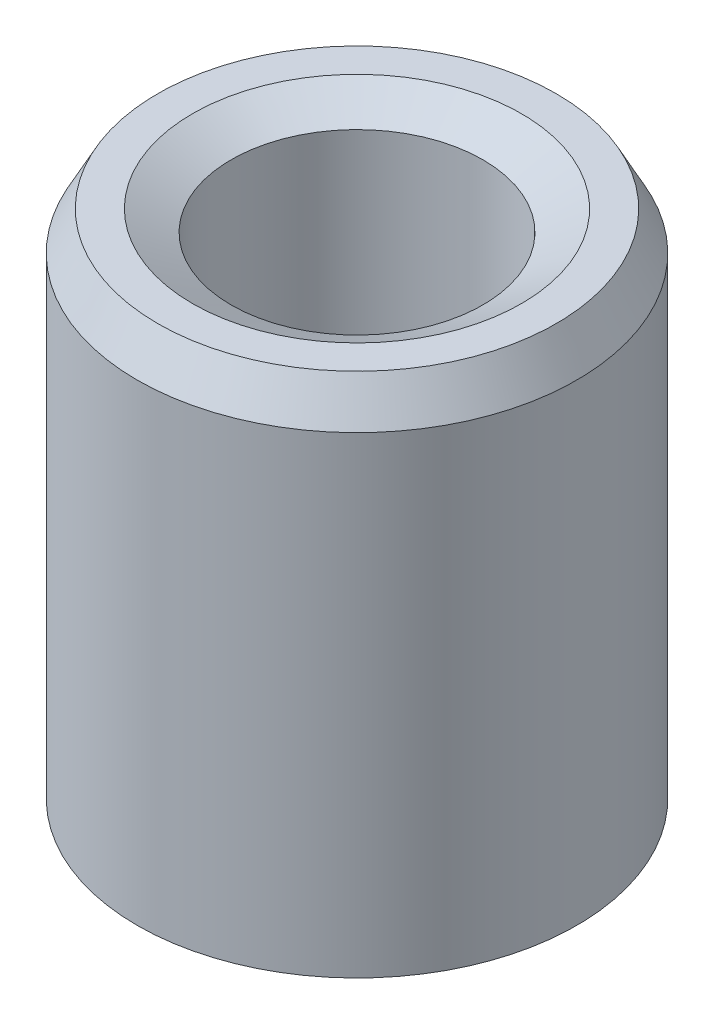
ISO-10303-21;
HEADER;
FILE_DESCRIPTION(('STEP AP214'),'2;1');
FILE_NAME('part.step','',(''),(''),'','','');
FILE_SCHEMA(('AUTOMOTIVE_DESIGN { 1 0 10303 214 1 1 1 1 }'));
ENDSEC;
DATA;
#1=APPLICATION_CONTEXT('core data for automotive mechanical design processes');
#2=APPLICATION_PROTOCOL_DEFINITION('international standard','automotive_design',2000,#1);
#3=PRODUCT_CONTEXT('',#1,'mechanical');
#4=PRODUCT('Part','Part','',(#3));
#5=PRODUCT_RELATED_PRODUCT_CATEGORY('part','',(#4));
#6=PRODUCT_DEFINITION_FORMATION('','',#4);
#7=PRODUCT_DEFINITION_CONTEXT('part definition',#1,'design');
#8=PRODUCT_DEFINITION('design','',#6,#7);
#9=PRODUCT_DEFINITION_SHAPE('','',#8);
#10=(LENGTH_UNIT() NAMED_UNIT(*) SI_UNIT(.MILLI.,.METRE.));
#11=(NAMED_UNIT(*) PLANE_ANGLE_UNIT() SI_UNIT($,.RADIAN.));
#12=(NAMED_UNIT(*) SI_UNIT($,.STERADIAN.) SOLID_ANGLE_UNIT());
#13=UNCERTAINTY_MEASURE_WITH_UNIT(LENGTH_MEASURE(1.E-05),#10,'distance_accuracy_value','');
#14=(GEOMETRIC_REPRESENTATION_CONTEXT(3) GLOBAL_UNCERTAINTY_ASSIGNED_CONTEXT((#13)) GLOBAL_UNIT_ASSIGNED_CONTEXT((#10,
#11,#12)) REPRESENTATION_CONTEXT('',''));
#15=CARTESIAN_POINT('',(0.,0.,0.));
#16=DIRECTION('',(0.,0.,1.));
#17=DIRECTION('',(1.,0.,0.));
#18=AXIS2_PLACEMENT_3D('',#15,#16,#17);
#19=CARTESIAN_POINT('',(0.,42.3251518716603,0.));
#20=DIRECTION('',(0.,-1.,0.));
#21=DIRECTION('',(0.,0.,-1.));
#22=AXIS2_PLACEMENT_3D('',#19,#20,#21);
#23=CYLINDRICAL_SURFACE('',#22,17.5);
#24=CARTESIAN_POINT('',(0.,1.63485500538893,0.));
#25=DIRECTION('',(0.,1.,0.));
#26=DIRECTION('',(0.,0.,1.));
#27=AXIS2_PLACEMENT_3D('',#24,#25,#26);
#28=CIRCLE('',#27,17.5);
#29=CARTESIAN_POINT('',(0.,1.63485500538893,17.5));
#30=VERTEX_POINT('',#29);
#31=EDGE_CURVE('E10',#30,#30,#28,.T.);
#32=ORIENTED_EDGE('',*,*,#31,.T.);
#33=EDGE_LOOP('',(#32));
#34=FACE_BOUND('',#33,.T.);
#35=CARTESIAN_POINT('',(0.,39.2470877459745,0.));
#36=DIRECTION('',(0.,1.,0.));
#37=DIRECTION('',(0.,0.,1.));
#38=AXIS2_PLACEMENT_3D('',#35,#36,#37);
#39=CIRCLE('',#38,17.5);
#40=CARTESIAN_POINT('',(0.,39.2470877459745,-17.5));
#41=VERTEX_POINT('',#40);
#42=EDGE_CURVE('E50',#41,#41,#39,.F.);
#43=ORIENTED_EDGE('',*,*,#42,.T.);
#44=EDGE_LOOP('',(#43));
#45=FACE_BOUND('',#44,.T.);
#46=ADVANCED_FACE('F39',(#34,#45),#23,.T.);
#47=CARTESIAN_POINT('',(0.,42.3251518716603,0.));
#48=DIRECTION('',(0.,1.,0.));
#49=DIRECTION('',(0.,0.,1.));
#50=AXIS2_PLACEMENT_3D('',#47,#48,#49);
#51=PLANE('',#50);
#52=CARTESIAN_POINT('',(0.,42.3251518716603,0.));
#53=DIRECTION('',(0.,1.,0.));
#54=DIRECTION('',(0.,0.,1.));
#55=AXIS2_PLACEMENT_3D('',#52,#53,#54);
#56=CIRCLE('',#55,13.1011488150454);
#57=CARTESIAN_POINT('',(0.,42.3251518716603,13.1011488150454));
#58=VERTEX_POINT('',#57);
#59=EDGE_CURVE('E58',#58,#58,#56,.F.);
#60=ORIENTED_EDGE('',*,*,#59,.T.);
#61=EDGE_LOOP('',(#60));
#62=FACE_BOUND('',#61,.T.);
#63=CARTESIAN_POINT('',(0.,42.3251518716603,0.));
#64=DIRECTION('',(0.,1.,0.));
#65=DIRECTION('',(0.,0.,1.));
#66=AXIS2_PLACEMENT_3D('',#63,#64,#65);
#67=CIRCLE('',#66,15.8651449946111);
#68=CARTESIAN_POINT('',(0.,42.3251518716603,-15.8651449946111));
#69=VERTEX_POINT('',#68);
#70=EDGE_CURVE('E61',#69,#69,#67,.T.);
#71=ORIENTED_EDGE('',*,*,#70,.T.);
#72=EDGE_LOOP('',(#71));
#73=FACE_BOUND('',#72,.T.);
#74=ADVANCED_FACE('F88',(#62,#73),#51,.T.);
#75=CARTESIAN_POINT('',(0.,0.,0.));
#76=DIRECTION('',(0.,1.,0.));
#77=DIRECTION('',(0.,0.,1.));
#78=AXIS2_PLACEMENT_3D('',#75,#76,#77);
#79=PLANE('',#78);
#80=CARTESIAN_POINT('',(0.,0.,0.));
#81=DIRECTION('',(0.,1.,0.));
#82=DIRECTION('',(0.,0.,1.));
#83=AXIS2_PLACEMENT_3D('',#80,#81,#82);
#84=CIRCLE('',#83,11.6579396947486);
#85=CARTESIAN_POINT('',(0.,0.,11.6579396947486));
#86=VERTEX_POINT('',#85);
#87=EDGE_CURVE('E51',#86,#86,#84,.T.);
#88=ORIENTED_EDGE('',*,*,#87,.T.);
#89=EDGE_LOOP('',(#88));
#90=FACE_BOUND('',#89,.T.);
#91=CARTESIAN_POINT('',(0.,0.,0.));
#92=DIRECTION('',(0.,1.,0.));
#93=DIRECTION('',(0.,0.,1.));
#94=AXIS2_PLACEMENT_3D('',#91,#92,#93);
#95=CIRCLE('',#94,14.4219358743143);
#96=CARTESIAN_POINT('',(0.,0.,14.4219358743143));
#97=VERTEX_POINT('',#96);
#98=EDGE_CURVE('E54',#97,#97,#95,.F.);
#99=ORIENTED_EDGE('',*,*,#98,.T.);
#100=EDGE_LOOP('',(#99));
#101=FACE_BOUND('',#100,.T.);
#102=ADVANCED_FACE('F83',(#90,#101),#79,.F.);
#103=CARTESIAN_POINT('',(0.,42.3251518716603,0.));
#104=DIRECTION('',(0.,-1.,0.));
#105=DIRECTION('',(0.,0.,-1.));
#106=AXIS2_PLACEMENT_3D('',#103,#104,#105);
#107=CYLINDRICAL_SURFACE('',#106,10.0230846893597);
#108=CARTESIAN_POINT('',(0.,40.6902968662713,0.));
#109=DIRECTION('',(0.,1.,0.));
#110=DIRECTION('',(0.,0.,1.));
#111=AXIS2_PLACEMENT_3D('',#108,#109,#110);
#112=CIRCLE('',#111,10.0230846893597);
#113=CARTESIAN_POINT('',(0.,40.6902968662713,10.0230846893597));
#114=VERTEX_POINT('',#113);
#115=EDGE_CURVE('E67',#114,#114,#112,.T.);
#116=ORIENTED_EDGE('',*,*,#115,.T.);
#117=EDGE_LOOP('',(#116));
#118=FACE_BOUND('',#117,.T.);
#119=CARTESIAN_POINT('',(0.,3.07806412568572,0.));
#120=DIRECTION('',(0.,1.,0.));
#121=DIRECTION('',(0.,0.,1.));
#122=AXIS2_PLACEMENT_3D('',#119,#120,#121);
#123=CIRCLE('',#122,10.0230846893597);
#124=CARTESIAN_POINT('',(0.,3.07806412568572,10.0230846893597));
#125=VERTEX_POINT('',#124);
#126=EDGE_CURVE('E69',#125,#125,#123,.F.);
#127=ORIENTED_EDGE('',*,*,#126,.T.);
#128=EDGE_LOOP('',(#127));
#129=FACE_BOUND('',#128,.T.);
#130=ADVANCED_FACE('F71',(#118,#129),#107,.F.);
#131=CARTESIAN_POINT('',(0.,40.6902968662713,0.));
#132=DIRECTION('',(0.,1.,0.));
#133=DIRECTION('',(0.,0.,1.));
#134=AXIS2_PLACEMENT_3D('',#131,#132,#133);
#135=CONICAL_SURFACE('',#134,10.0230846893597,1.08255525648634);
#136=ORIENTED_EDGE('',*,*,#59,.F.);
#137=EDGE_LOOP('',(#136));
#138=FACE_BOUND('',#137,.T.);
#139=ORIENTED_EDGE('',*,*,#115,.F.);
#140=EDGE_LOOP('',(#139));
#141=FACE_BOUND('',#140,.T.);
#142=ADVANCED_FACE('F77',(#138,#141),#135,.F.);
#143=CARTESIAN_POINT('',(0.,0.,0.));
#144=DIRECTION('',(0.,-1.,0.));
#145=DIRECTION('',(0.,0.,-1.));
#146=AXIS2_PLACEMENT_3D('',#143,#144,#145);
#147=CONICAL_SURFACE('',#146,11.6579396947486,0.488241070308555);
#148=ORIENTED_EDGE('',*,*,#126,.F.);
#149=EDGE_LOOP('',(#148));
#150=FACE_BOUND('',#149,.T.);
#151=ORIENTED_EDGE('',*,*,#87,.F.);
#152=EDGE_LOOP('',(#151));
#153=FACE_BOUND('',#152,.T.);
#154=ADVANCED_FACE('F73',(#150,#153),#147,.F.);
#155=CARTESIAN_POINT('',(0.,1.63485500538893,0.));
#156=DIRECTION('',(0.,1.,0.));
#157=DIRECTION('',(0.,0.,1.));
#158=AXIS2_PLACEMENT_3D('',#155,#156,#157);
#159=CONICAL_SURFACE('',#158,17.5,1.08255525648634);
#160=ORIENTED_EDGE('',*,*,#98,.F.);
#161=EDGE_LOOP('',(#160));
#162=FACE_BOUND('',#161,.T.);
#163=ORIENTED_EDGE('',*,*,#31,.F.);
#164=EDGE_LOOP('',(#163));
#165=FACE_BOUND('',#164,.T.);
#166=ADVANCED_FACE('F76',(#162,#165),#159,.T.);
#167=CARTESIAN_POINT('',(0.,42.3251518716603,0.));
#168=DIRECTION('',(0.,-1.,0.));
#169=DIRECTION('',(0.,0.,-1.));
#170=AXIS2_PLACEMENT_3D('',#167,#168,#169);
#171=CONICAL_SURFACE('',#170,15.8651449946111,0.488241070308554);
#172=CARTESIAN_POINT('',(0.,39.2470877459745,-17.5));
#173=CARTESIAN_POINT('',(0.,39.2791509139504,-17.4829702603605));
#174=CARTESIAN_POINT('',(0.,39.3112140819263,-17.4659405207211));
#175=CARTESIAN_POINT('',(0.,39.3753404178781,-17.4318810414421));
#176=CARTESIAN_POINT('',(0.,39.407403585854,-17.4148513018027));
#177=CARTESIAN_POINT('',(0.,39.4715299218058,-17.3807918225237));
#178=CARTESIAN_POINT('',(0.,39.5035930897817,-17.3637620828843));
#179=CARTESIAN_POINT('',(0.,39.5677194257335,-17.3297026036053));
#180=CARTESIAN_POINT('',(0.,39.5997825937094,-17.3126728639659));
#181=CARTESIAN_POINT('',(0.,39.6639089296612,-17.2786133846869));
#182=CARTESIAN_POINT('',(0.,39.695972097637,-17.2615836450474));
#183=CARTESIAN_POINT('',(0.,39.7600984335888,-17.2275241657685));
#184=CARTESIAN_POINT('',(0.,39.7921616015647,-17.210494426129));
#185=CARTESIAN_POINT('',(0.,39.8562879375165,-17.1764349468501));
#186=CARTESIAN_POINT('',(0.,39.8883511054924,-17.1594052072106));
#187=CARTESIAN_POINT('',(0.,39.9524774414442,-17.1253457279317));
#188=CARTESIAN_POINT('',(0.,39.9845406094201,-17.1083159882922));
#189=CARTESIAN_POINT('',(0.,40.0486669453719,-17.0742565090133));
#190=CARTESIAN_POINT('',(0.,40.0807301133478,-17.0572267693738));
#191=CARTESIAN_POINT('',(0.,40.1448564492995,-17.0231672900949));
#192=CARTESIAN_POINT('',(0.,40.1769196172754,-17.0061375504554));
#193=CARTESIAN_POINT('',(0.,40.2410459532272,-16.9720780711765));
#194=CARTESIAN_POINT('',(0.,40.2731091212031,-16.955048331537));
#195=CARTESIAN_POINT('',(0.,40.3372354571549,-16.9209888522581));
#196=CARTESIAN_POINT('',(0.,40.3692986251308,-16.9039591126186));
#197=CARTESIAN_POINT('',(0.,40.4334249610826,-16.8698996333397));
#198=CARTESIAN_POINT('',(0.,40.4654881290585,-16.8528698937002));
#199=CARTESIAN_POINT('',(0.,40.5296144650103,-16.8188104144213));
#200=CARTESIAN_POINT('',(0.,40.5616776329862,-16.8017806747818));
#201=CARTESIAN_POINT('',(0.,40.6258039689379,-16.7677211955029));
#202=CARTESIAN_POINT('',(0.,40.6578671369138,-16.7506914558634));
#203=CARTESIAN_POINT('',(0.,40.7219934728656,-16.7166319765845));
#204=CARTESIAN_POINT('',(0.,40.7540566408415,-16.699602236945));
#205=CARTESIAN_POINT('',(0.,40.8181829767933,-16.6655427576661));
#206=CARTESIAN_POINT('',(0.,40.8502461447692,-16.6485130180266));
#207=CARTESIAN_POINT('',(0.,40.914372480721,-16.6144535387477));
#208=CARTESIAN_POINT('',(0.,40.9464356486969,-16.5974237991082));
#209=CARTESIAN_POINT('',(0.,41.0105619846487,-16.5633643198293));
#210=CARTESIAN_POINT('',(0.,41.0426251526246,-16.5463345801898));
#211=CARTESIAN_POINT('',(0.,41.1067514885763,-16.5122751009109));
#212=CARTESIAN_POINT('',(0.,41.1388146565522,-16.4952453612714));
#213=CARTESIAN_POINT('',(0.,41.202940992504,-16.4611858819924));
#214=CARTESIAN_POINT('',(0.,41.2350041604799,-16.444156142353));
#215=CARTESIAN_POINT('',(0.,41.2991304964317,-16.410096663074));
#216=CARTESIAN_POINT('',(0.,41.3311936644076,-16.3930669234346));
#217=CARTESIAN_POINT('',(0.,41.3953200003594,-16.3590074441556));
#218=CARTESIAN_POINT('',(0.,41.4273831683353,-16.3419777045162));
#219=CARTESIAN_POINT('',(0.,41.4915095042871,-16.3079182252372));
#220=CARTESIAN_POINT('',(0.,41.523572672263,-16.2908884855978));
#221=CARTESIAN_POINT('',(0.,41.5876990082147,-16.2568290063188));
#222=CARTESIAN_POINT('',(0.,41.6197621761906,-16.2397992666794));
#223=CARTESIAN_POINT('',(0.,41.6838885121424,-16.2057397874004));
#224=CARTESIAN_POINT('',(0.,41.7159516801183,-16.188710047761));
#225=CARTESIAN_POINT('',(0.,41.7800780160701,-16.154650568482));
#226=CARTESIAN_POINT('',(0.,41.812141184046,-16.1376208288426));
#227=CARTESIAN_POINT('',(0.,41.8762675199978,-16.1035613495636));
#228=CARTESIAN_POINT('',(0.,41.9083306879737,-16.0865316099242));
#229=CARTESIAN_POINT('',(0.,41.9724570239255,-16.0524721306452));
#230=CARTESIAN_POINT('',(0.,42.0045201919013,-16.0354423910057));
#231=CARTESIAN_POINT('',(0.,42.0686465278531,-16.0013829117268));
#232=CARTESIAN_POINT('',(0.,42.100709695829,-15.9843531720873));
#233=CARTESIAN_POINT('',(0.,42.1648360317808,-15.9502936928084));
#234=CARTESIAN_POINT('',(0.,42.1968991997567,-15.9332639531689));
#235=CARTESIAN_POINT('',(0.,42.2610255357085,-15.89920447389));
#236=CARTESIAN_POINT('',(0.,42.2930887036844,-15.8821747342505));
#237=CARTESIAN_POINT('',(0.,42.3251518716603,-15.8651449946111));
#238=B_SPLINE_CURVE_WITH_KNOTS('',3,(#172,#173,#174,#175,#176,#177,#178,#179,#180,#181,#182,
#183,#184,#185,#186,#187,#188,#189,#190,#191,#192,#193,#194,#195,#196,#197,#198,#199,#200,#201,
#202,#203,#204,#205,#206,#207,#208,#209,#210,#211,#212,#213,#214,#215,#216,#217,#218,#219,#220,
#221,#222,#223,#224,#225,#226,#227,#228,#229,#230,#231,#232,#233,#234,#235,#236,#237),
.UNSPECIFIED.,.F.,.F.,(4,2,2,2,2,2,2,2,2,2,2,2,2,2,2,2,2,2,2,2,2,2,2,2,2,2,2,2,2,2,2,2,4),(0.,
0.108915237481016,0.217830474962031,0.326745712443047,0.435660949924063,0.544576187405072,
0.653491424886086,0.762406662367102,0.871321899848117,0.980237137329127,1.08915237481014,
1.19806761229116,1.30698284977217,1.41589808725319,1.5248133247342,1.63372856221521,
1.74264379969623,1.85155903717724,1.96047427465826,2.06938951213927,2.17830474962028,
2.2872199871013,2.39613522458231,2.50505046206332,2.61396569954434,2.72288093702535,
2.83179617450637,2.94071141198738,3.04962664946839,3.15854188694941,3.26745712443042,
3.37637236191144,3.48528759939245),.UNSPECIFIED.);
#239=EDGE_CURVE('BSEAM45',#41,#69,#238,.T.);
#240=ORIENTED_EDGE('',*,*,#42,.F.);
#241=ORIENTED_EDGE('',*,*,#70,.F.);
#242=ORIENTED_EDGE('',*,*,#239,.T.);
#243=ORIENTED_EDGE('',*,*,#239,.F.);
#244=EDGE_LOOP('',(#240,#242,#241,#243));
#245=FACE_BOUND('',#244,.T.);
#246=ADVANCED_FACE('F45',(#245),#171,.T.);
#247=CLOSED_SHELL('',(#46,#74,#102,#130,#142,#154,#166,#246));
#248=MANIFOLD_SOLID_BREP('B2',#247);
#249=ADVANCED_BREP_SHAPE_REPRESENTATION('',(#18,#248),#14);
#250=SHAPE_DEFINITION_REPRESENTATION(#9,#249);
ENDSEC;
END-ISO-10303-21;
